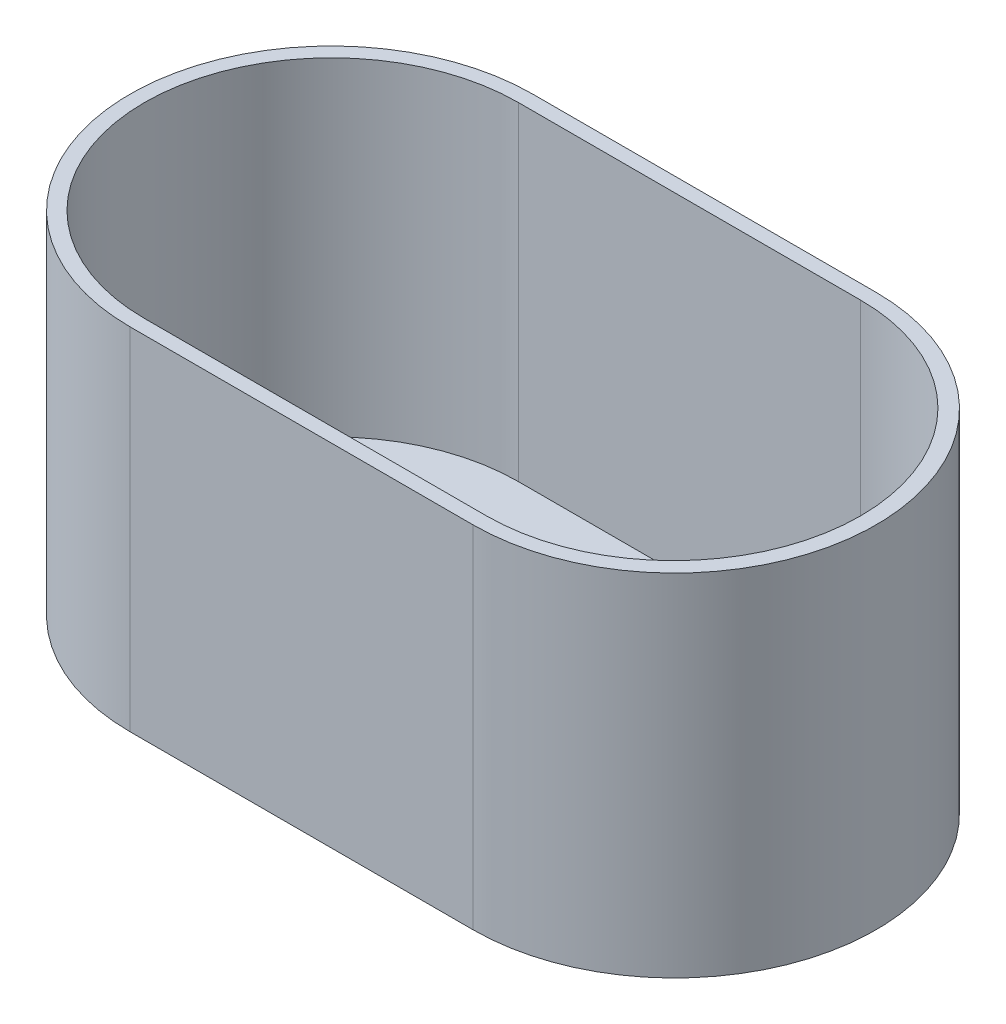
ISO-10303-21;
HEADER;
FILE_DESCRIPTION(('STEP AP214'),'2;1');
FILE_NAME('part.step','',(''),(''),'','','');
FILE_SCHEMA(('AUTOMOTIVE_DESIGN { 1 0 10303 214 1 1 1 1 }'));
ENDSEC;
DATA;
#1=APPLICATION_CONTEXT('core data for automotive mechanical design processes');
#2=APPLICATION_PROTOCOL_DEFINITION('international standard','automotive_design',2000,#1);
#3=PRODUCT_CONTEXT('',#1,'mechanical');
#4=PRODUCT('Part','Part','',(#3));
#5=PRODUCT_RELATED_PRODUCT_CATEGORY('part','',(#4));
#6=PRODUCT_DEFINITION_FORMATION('','',#4);
#7=PRODUCT_DEFINITION_CONTEXT('part definition',#1,'design');
#8=PRODUCT_DEFINITION('design','',#6,#7);
#9=PRODUCT_DEFINITION_SHAPE('','',#8);
#10=(LENGTH_UNIT() NAMED_UNIT(*) SI_UNIT(.MILLI.,.METRE.));
#11=(NAMED_UNIT(*) PLANE_ANGLE_UNIT() SI_UNIT($,.RADIAN.));
#12=(NAMED_UNIT(*) SI_UNIT($,.STERADIAN.) SOLID_ANGLE_UNIT());
#13=UNCERTAINTY_MEASURE_WITH_UNIT(LENGTH_MEASURE(1.E-05),#10,'distance_accuracy_value','');
#14=(GEOMETRIC_REPRESENTATION_CONTEXT(3) GLOBAL_UNCERTAINTY_ASSIGNED_CONTEXT((#13)) GLOBAL_UNIT_ASSIGNED_CONTEXT((#10,
#11,#12)) REPRESENTATION_CONTEXT('',''));
#15=CARTESIAN_POINT('',(0.,0.,0.));
#16=DIRECTION('',(0.,0.,1.));
#17=DIRECTION('',(1.,0.,0.));
#18=AXIS2_PLACEMENT_3D('',#15,#16,#17);
#19=CARTESIAN_POINT('',(0.,0.,0.));
#20=DIRECTION('',(0.,1.,0.));
#21=DIRECTION('',(0.,0.,1.));
#22=AXIS2_PLACEMENT_3D('',#19,#20,#21);
#23=PLANE('',#22);
#24=CARTESIAN_POINT('',(45.8562816382713,0.,0.));
#25=DIRECTION('',(0.,1.,0.));
#26=DIRECTION('',(0.,0.,1.));
#27=AXIS2_PLACEMENT_3D('',#24,#25,#26);
#28=CIRCLE('',#27,25.0593912215888);
#29=CARTESIAN_POINT('',(45.8562816382713,0.,25.0593912215888));
#30=VERTEX_POINT('',#29);
#31=CARTESIAN_POINT('',(45.8562816382713,0.,-25.0593912215888));
#32=VERTEX_POINT('',#31);
#33=EDGE_CURVE('E296',#30,#32,#28,.T.);
#34=ORIENTED_EDGE('',*,*,#33,.T.);
#35=DIRECTION('',(-1.,0.,0.));
#36=VECTOR('',#35,1.);
#37=CARTESIAN_POINT('',(0.,0.,-25.0593912215888));
#38=LINE('',#37,#36);
#39=CARTESIAN_POINT('',(0.,0.,-25.0593912215888));
#40=VERTEX_POINT('',#39);
#41=EDGE_CURVE('E43',#32,#40,#38,.T.);
#42=ORIENTED_EDGE('',*,*,#41,.T.);
#43=CARTESIAN_POINT('',(0.,0.,0.));
#44=DIRECTION('',(0.,1.,0.));
#45=DIRECTION('',(0.,0.,1.));
#46=AXIS2_PLACEMENT_3D('',#43,#44,#45);
#47=CIRCLE('',#46,25.0593912215888);
#48=CARTESIAN_POINT('',(0.,0.,25.0593912215888));
#49=VERTEX_POINT('',#48);
#50=EDGE_CURVE('E11',#40,#49,#47,.T.);
#51=ORIENTED_EDGE('',*,*,#50,.T.);
#52=DIRECTION('',(1.,0.,0.));
#53=VECTOR('',#52,1.);
#54=CARTESIAN_POINT('',(0.,0.,25.0593912215888));
#55=LINE('',#54,#53);
#56=EDGE_CURVE('E293',#49,#30,#55,.T.);
#57=ORIENTED_EDGE('',*,*,#56,.T.);
#58=EDGE_LOOP('',(#34,#42,#51,#57));
#59=FACE_BOUND('',#58,.T.);
#60=DIRECTION('',(0.,0.,-1.));
#61=VECTOR('',#60,1.);
#62=CARTESIAN_POINT('',(-9.28679565647911,0.,-11.7941977931354));
#63=LINE('',#62,#61);
#64=CARTESIAN_POINT('',(-9.28679565647911,0.,-10.0856422401896));
#65=VERTEX_POINT('',#64);
#66=CARTESIAN_POINT('',(-9.28679565647911,0.,-11.7941977931354));
#67=VERTEX_POINT('',#66);
#68=EDGE_CURVE('E201',#65,#67,#63,.T.);
#69=ORIENTED_EDGE('',*,*,#68,.F.);
#70=DIRECTION('',(1.,0.,0.));
#71=VECTOR('',#70,1.);
#72=CARTESIAN_POINT('',(-9.28679565647911,0.,-10.0856422401896));
#73=LINE('',#72,#71);
#74=CARTESIAN_POINT('',(-13.9397210193438,0.,-10.0856422401896));
#75=VERTEX_POINT('',#74);
#76=EDGE_CURVE('E198',#75,#65,#73,.T.);
#77=ORIENTED_EDGE('',*,*,#76,.F.);
#78=DIRECTION('',(0.,0.,-1.));
#79=VECTOR('',#78,1.);
#80=CARTESIAN_POINT('',(-13.9397210193438,0.,-10.0856422401896));
#81=LINE('',#80,#79);
#82=CARTESIAN_POINT('',(-13.9397210193438,0.,-4.69528190445842));
#83=VERTEX_POINT('',#82);
#84=EDGE_CURVE('E211',#83,#75,#81,.T.);
#85=ORIENTED_EDGE('',*,*,#84,.F.);
#86=DIRECTION('',(1.,0.,0.));
#87=VECTOR('',#86,1.);
#88=CARTESIAN_POINT('',(-13.9397210193438,0.,-4.69528190445842));
#89=LINE('',#88,#87);
#90=CARTESIAN_POINT('',(-15.6758199562884,0.,-4.69528190445842));
#91=VERTEX_POINT('',#90);
#92=EDGE_CURVE('E227',#91,#83,#89,.T.);
#93=ORIENTED_EDGE('',*,*,#92,.F.);
#94=DIRECTION('',(0.,0.,1.));
#95=VECTOR('',#94,1.);
#96=CARTESIAN_POINT('',(-15.6758199562884,0.,-4.69528190445842));
#97=LINE('',#96,#95);
#98=CARTESIAN_POINT('',(-15.6758199562884,0.,-11.7941977931354));
#99=VERTEX_POINT('',#98);
#100=EDGE_CURVE('E225',#99,#91,#97,.T.);
#101=ORIENTED_EDGE('',*,*,#100,.F.);
#102=DIRECTION('',(-1.,0.,0.));
#103=VECTOR('',#102,1.);
#104=CARTESIAN_POINT('',(-15.6758199562884,0.,-11.7941977931354));
#105=LINE('',#104,#103);
#106=EDGE_CURVE('E223',#67,#99,#105,.T.);
#107=ORIENTED_EDGE('',*,*,#106,.F.);
#108=EDGE_LOOP('',(#69,#77,#85,#93,#101,#107));
#109=FACE_BOUND('',#108,.T.);
#110=DIRECTION('',(0.,0.,1.));
#111=VECTOR('',#110,1.);
#112=CARTESIAN_POINT('',(21.6949015433899,0.,11.8350508077465));
#113=LINE('',#112,#111);
#114=CARTESIAN_POINT('',(21.6949015433899,0.,10.1264952548008));
#115=VERTEX_POINT('',#114);
#116=CARTESIAN_POINT('',(21.6949015433899,0.,11.8350508077465));
#117=VERTEX_POINT('',#116);
#118=EDGE_CURVE('E604',#115,#117,#113,.T.);
#119=ORIENTED_EDGE('',*,*,#118,.F.);
#120=DIRECTION('',(-1.,0.,0.));
#121=VECTOR('',#120,1.);
#122=CARTESIAN_POINT('',(21.6949015433899,0.,10.1264952548008));
#123=LINE('',#122,#121);
#124=CARTESIAN_POINT('',(26.3478269062546,0.,10.1264952548008));
#125=VERTEX_POINT('',#124);
#126=EDGE_CURVE('E196',#125,#115,#123,.T.);
#127=ORIENTED_EDGE('',*,*,#126,.F.);
#128=DIRECTION('',(0.,0.,1.));
#129=VECTOR('',#128,1.);
#130=CARTESIAN_POINT('',(26.3478269062546,0.,10.1264952548008));
#131=LINE('',#130,#129);
#132=CARTESIAN_POINT('',(26.3478269062546,0.,4.73613491906954));
#133=VERTEX_POINT('',#132);
#134=EDGE_CURVE('E192',#133,#125,#131,.T.);
#135=ORIENTED_EDGE('',*,*,#134,.F.);
#136=DIRECTION('',(-1.,0.,0.));
#137=VECTOR('',#136,1.);
#138=CARTESIAN_POINT('',(26.3478269062546,0.,4.73613491906954));
#139=LINE('',#138,#137);
#140=CARTESIAN_POINT('',(28.0839258431991,0.,4.73613491906954));
#141=VERTEX_POINT('',#140);
#142=EDGE_CURVE('E600',#141,#133,#139,.T.);
#143=ORIENTED_EDGE('',*,*,#142,.F.);
#144=DIRECTION('',(0.,0.,-1.));
#145=VECTOR('',#144,1.);
#146=CARTESIAN_POINT('',(28.0839258431991,0.,4.73613491906954));
#147=LINE('',#146,#145);
#148=CARTESIAN_POINT('',(28.0839258431991,0.,11.8350508077465));
#149=VERTEX_POINT('',#148);
#150=EDGE_CURVE('E612',#149,#141,#147,.T.);
#151=ORIENTED_EDGE('',*,*,#150,.F.);
#152=DIRECTION('',(1.,0.,0.));
#153=VECTOR('',#152,1.);
#154=CARTESIAN_POINT('',(28.0839258431991,0.,11.8350508077465));
#155=LINE('',#154,#153);
#156=EDGE_CURVE('E606',#117,#149,#155,.T.);
#157=ORIENTED_EDGE('',*,*,#156,.F.);
#158=EDGE_LOOP('',(#119,#127,#135,#143,#151,#157));
#159=FACE_BOUND('',#158,.T.);
#160=ADVANCED_FACE('F35',(#59,#109,#159),#23,.T.);
#161=CARTESIAN_POINT('',(0.,44.,0.));
#162=DIRECTION('',(0.,-1.,0.));
#163=DIRECTION('',(0.,0.,-1.));
#164=AXIS2_PLACEMENT_3D('',#161,#162,#163);
#165=CYLINDRICAL_SURFACE('',#164,27.);
#166=DIRECTION('',(0.,-1.,0.));
#167=VECTOR('',#166,1.);
#168=CARTESIAN_POINT('',(0.,44.,-27.));
#169=LINE('',#168,#167);
#170=CARTESIAN_POINT('',(0.,44.,-27.));
#171=VERTEX_POINT('',#170);
#172=CARTESIAN_POINT('',(0.,-2.99999999999999,-27.));
#173=VERTEX_POINT('',#172);
#174=EDGE_CURVE('E285',#171,#173,#169,.T.);
#175=ORIENTED_EDGE('',*,*,#174,.T.);
#176=CARTESIAN_POINT('',(0.,-2.99999999999999,0.));
#177=DIRECTION('',(0.,1.,0.));
#178=DIRECTION('',(0.,0.,1.));
#179=AXIS2_PLACEMENT_3D('',#176,#177,#178);
#180=CIRCLE('',#179,27.);
#181=CARTESIAN_POINT('',(0.,-2.99999999999999,27.));
#182=VERTEX_POINT('',#181);
#183=EDGE_CURVE('E244',#173,#182,#180,.T.);
#184=ORIENTED_EDGE('',*,*,#183,.T.);
#185=DIRECTION('',(0.,-1.,0.));
#186=VECTOR('',#185,1.);
#187=CARTESIAN_POINT('',(0.,44.,27.));
#188=LINE('',#187,#186);
#189=CARTESIAN_POINT('',(0.,44.,27.));
#190=VERTEX_POINT('',#189);
#191=EDGE_CURVE('E291',#190,#182,#188,.T.);
#192=ORIENTED_EDGE('',*,*,#191,.F.);
#193=CARTESIAN_POINT('',(0.,44.,0.));
#194=DIRECTION('',(0.,1.,0.));
#195=DIRECTION('',(0.,0.,1.));
#196=AXIS2_PLACEMENT_3D('',#193,#194,#195);
#197=CIRCLE('',#196,27.);
#198=EDGE_CURVE('E276',#171,#190,#197,.T.);
#199=ORIENTED_EDGE('',*,*,#198,.F.);
#200=EDGE_LOOP('',(#175,#184,#192,#199));
#201=FACE_BOUND('',#200,.T.);
#202=ADVANCED_FACE('F37',(#201),#165,.T.);
#203=CARTESIAN_POINT('',(0.,44.,27.));
#204=DIRECTION('',(0.,0.,-1.));
#205=DIRECTION('',(-1.,0.,0.));
#206=AXIS2_PLACEMENT_3D('',#203,#204,#205);
#207=PLANE('',#206);
#208=ORIENTED_EDGE('',*,*,#191,.T.);
#209=DIRECTION('',(1.,0.,0.));
#210=VECTOR('',#209,1.);
#211=CARTESIAN_POINT('',(0.,-2.99999999999999,27.));
#212=LINE('',#211,#210);
#213=CARTESIAN_POINT('',(46.,-2.99999999999999,27.));
#214=VERTEX_POINT('',#213);
#215=EDGE_CURVE('E247',#182,#214,#212,.T.);
#216=ORIENTED_EDGE('',*,*,#215,.T.);
#217=DIRECTION('',(0.,-1.,0.));
#218=VECTOR('',#217,1.);
#219=CARTESIAN_POINT('',(46.,44.,27.));
#220=LINE('',#219,#218);
#221=CARTESIAN_POINT('',(46.,44.,27.));
#222=VERTEX_POINT('',#221);
#223=EDGE_CURVE('E289',#222,#214,#220,.T.);
#224=ORIENTED_EDGE('',*,*,#223,.F.);
#225=DIRECTION('',(1.,0.,0.));
#226=VECTOR('',#225,1.);
#227=CARTESIAN_POINT('',(0.,44.,27.));
#228=LINE('',#227,#226);
#229=EDGE_CURVE('E279',#190,#222,#228,.T.);
#230=ORIENTED_EDGE('',*,*,#229,.F.);
#231=EDGE_LOOP('',(#208,#216,#224,#230));
#232=FACE_BOUND('',#231,.T.);
#233=ADVANCED_FACE('F334',(#232),#207,.F.);
#234=CARTESIAN_POINT('',(46.,44.,0.));
#235=DIRECTION('',(0.,-1.,0.));
#236=DIRECTION('',(0.,0.,-1.));
#237=AXIS2_PLACEMENT_3D('',#234,#235,#236);
#238=CYLINDRICAL_SURFACE('',#237,27.);
#239=ORIENTED_EDGE('',*,*,#223,.T.);
#240=CARTESIAN_POINT('',(46.,-2.99999999999999,0.));
#241=DIRECTION('',(0.,1.,0.));
#242=DIRECTION('',(0.,0.,1.));
#243=AXIS2_PLACEMENT_3D('',#240,#241,#242);
#244=CIRCLE('',#243,27.);
#245=CARTESIAN_POINT('',(46.,-2.99999999999999,-27.));
#246=VERTEX_POINT('',#245);
#247=EDGE_CURVE('E250',#214,#246,#244,.T.);
#248=ORIENTED_EDGE('',*,*,#247,.T.);
#249=DIRECTION('',(0.,-1.,0.));
#250=VECTOR('',#249,1.);
#251=CARTESIAN_POINT('',(46.,44.,-27.));
#252=LINE('',#251,#250);
#253=CARTESIAN_POINT('',(46.,44.,-27.));
#254=VERTEX_POINT('',#253);
#255=EDGE_CURVE('E287',#254,#246,#252,.T.);
#256=ORIENTED_EDGE('',*,*,#255,.F.);
#257=CARTESIAN_POINT('',(46.,44.,0.));
#258=DIRECTION('',(0.,1.,0.));
#259=DIRECTION('',(0.,0.,1.));
#260=AXIS2_PLACEMENT_3D('',#257,#258,#259);
#261=CIRCLE('',#260,27.);
#262=EDGE_CURVE('E281',#222,#254,#261,.T.);
#263=ORIENTED_EDGE('',*,*,#262,.F.);
#264=EDGE_LOOP('',(#239,#248,#256,#263));
#265=FACE_BOUND('',#264,.T.);
#266=ADVANCED_FACE('F488',(#265),#238,.T.);
#267=CARTESIAN_POINT('',(0.,44.,-27.));
#268=DIRECTION('',(0.,0.,1.));
#269=DIRECTION('',(1.,0.,0.));
#270=AXIS2_PLACEMENT_3D('',#267,#268,#269);
#271=PLANE('',#270);
#272=ORIENTED_EDGE('',*,*,#255,.T.);
#273=DIRECTION('',(-1.,0.,0.));
#274=VECTOR('',#273,1.);
#275=CARTESIAN_POINT('',(0.,-2.99999999999999,-27.));
#276=LINE('',#275,#274);
#277=EDGE_CURVE('E253',#246,#173,#276,.T.);
#278=ORIENTED_EDGE('',*,*,#277,.T.);
#279=ORIENTED_EDGE('',*,*,#174,.F.);
#280=DIRECTION('',(-1.,0.,0.));
#281=VECTOR('',#280,1.);
#282=CARTESIAN_POINT('',(0.,44.,-27.));
#283=LINE('',#282,#281);
#284=EDGE_CURVE('E283',#254,#171,#283,.T.);
#285=ORIENTED_EDGE('',*,*,#284,.F.);
#286=EDGE_LOOP('',(#272,#278,#279,#285));
#287=FACE_BOUND('',#286,.T.);
#288=ADVANCED_FACE('F504',(#287),#271,.F.);
#289=CARTESIAN_POINT('',(0.,44.,0.));
#290=DIRECTION('',(0.,1.,0.));
#291=DIRECTION('',(0.,0.,1.));
#292=AXIS2_PLACEMENT_3D('',#289,#290,#291);
#293=PLANE('',#292);
#294=CARTESIAN_POINT('',(0.,44.,0.));
#295=DIRECTION('',(0.,1.,0.));
#296=DIRECTION('',(0.,0.,1.));
#297=AXIS2_PLACEMENT_3D('',#294,#295,#296);
#298=CIRCLE('',#297,25.0593912215888);
#299=CARTESIAN_POINT('',(0.,44.,-25.0593912215888));
#300=VERTEX_POINT('',#299);
#301=CARTESIAN_POINT('',(0.,44.,25.0593912215888));
#302=VERTEX_POINT('',#301);
#303=EDGE_CURVE('E273',#300,#302,#298,.T.);
#304=ORIENTED_EDGE('',*,*,#303,.F.);
#305=DIRECTION('',(-1.,0.,0.));
#306=VECTOR('',#305,1.);
#307=CARTESIAN_POINT('',(0.,44.,-25.0593912215888));
#308=LINE('',#307,#306);
#309=CARTESIAN_POINT('',(45.8562816382713,44.,-25.0593912215888));
#310=VERTEX_POINT('',#309);
#311=EDGE_CURVE('E271',#310,#300,#308,.T.);
#312=ORIENTED_EDGE('',*,*,#311,.F.);
#313=CARTESIAN_POINT('',(45.8562816382713,44.,0.));
#314=DIRECTION('',(0.,1.,0.));
#315=DIRECTION('',(0.,0.,1.));
#316=AXIS2_PLACEMENT_3D('',#313,#314,#315);
#317=CIRCLE('',#316,25.0593912215888);
#318=CARTESIAN_POINT('',(45.8562816382713,44.,25.0593912215888));
#319=VERTEX_POINT('',#318);
#320=EDGE_CURVE('E269',#319,#310,#317,.T.);
#321=ORIENTED_EDGE('',*,*,#320,.F.);
#322=DIRECTION('',(1.,0.,0.));
#323=VECTOR('',#322,1.);
#324=CARTESIAN_POINT('',(0.,44.,25.0593912215888));
#325=LINE('',#324,#323);
#326=EDGE_CURVE('E260',#302,#319,#325,.T.);
#327=ORIENTED_EDGE('',*,*,#326,.F.);
#328=EDGE_LOOP('',(#304,#312,#321,#327));
#329=FACE_BOUND('',#328,.T.);
#330=ORIENTED_EDGE('',*,*,#198,.T.);
#331=ORIENTED_EDGE('',*,*,#229,.T.);
#332=ORIENTED_EDGE('',*,*,#262,.T.);
#333=ORIENTED_EDGE('',*,*,#284,.T.);
#334=EDGE_LOOP('',(#330,#331,#332,#333));
#335=FACE_BOUND('',#334,.T.);
#336=ADVANCED_FACE('F313',(#329,#335),#293,.T.);
#337=CARTESIAN_POINT('',(0.,-2.,0.));
#338=DIRECTION('',(0.,1.,0.));
#339=DIRECTION('',(0.,0.,1.));
#340=AXIS2_PLACEMENT_3D('',#337,#338,#339);
#341=CYLINDRICAL_SURFACE('',#340,25.0593912215888);
#342=ORIENTED_EDGE('',*,*,#303,.T.);
#343=DIRECTION('',(0.,1.,0.));
#344=VECTOR('',#343,1.);
#345=CARTESIAN_POINT('',(0.,-2.,25.0593912215888));
#346=LINE('',#345,#344);
#347=EDGE_CURVE('E256',#49,#302,#346,.T.);
#348=ORIENTED_EDGE('',*,*,#347,.F.);
#349=ORIENTED_EDGE('',*,*,#50,.F.);
#350=DIRECTION('',(0.,1.,0.));
#351=VECTOR('',#350,1.);
#352=CARTESIAN_POINT('',(0.,-2.,-25.0593912215888));
#353=LINE('',#352,#351);
#354=EDGE_CURVE('E257',#40,#300,#353,.T.);
#355=ORIENTED_EDGE('',*,*,#354,.T.);
#356=EDGE_LOOP('',(#342,#348,#349,#355));
#357=FACE_BOUND('',#356,.T.);
#358=ADVANCED_FACE('F309',(#357),#341,.F.);
#359=CARTESIAN_POINT('',(0.,-2.,-25.0593912215888));
#360=DIRECTION('',(0.,0.,-1.));
#361=DIRECTION('',(-1.,0.,0.));
#362=AXIS2_PLACEMENT_3D('',#359,#360,#361);
#363=PLANE('',#362);
#364=ORIENTED_EDGE('',*,*,#311,.T.);
#365=ORIENTED_EDGE('',*,*,#354,.F.);
#366=ORIENTED_EDGE('',*,*,#41,.F.);
#367=DIRECTION('',(0.,1.,0.));
#368=VECTOR('',#367,1.);
#369=CARTESIAN_POINT('',(45.8562816382713,-2.,-25.0593912215888));
#370=LINE('',#369,#368);
#371=EDGE_CURVE('E261',#32,#310,#370,.T.);
#372=ORIENTED_EDGE('',*,*,#371,.T.);
#373=EDGE_LOOP('',(#364,#365,#366,#372));
#374=FACE_BOUND('',#373,.T.);
#375=ADVANCED_FACE('F305',(#374),#363,.F.);
#376=CARTESIAN_POINT('',(45.8562816382713,-2.,0.));
#377=DIRECTION('',(0.,1.,0.));
#378=DIRECTION('',(0.,0.,1.));
#379=AXIS2_PLACEMENT_3D('',#376,#377,#378);
#380=CYLINDRICAL_SURFACE('',#379,25.0593912215888);
#381=ORIENTED_EDGE('',*,*,#320,.T.);
#382=ORIENTED_EDGE('',*,*,#371,.F.);
#383=ORIENTED_EDGE('',*,*,#33,.F.);
#384=DIRECTION('',(0.,1.,0.));
#385=VECTOR('',#384,1.);
#386=CARTESIAN_POINT('',(45.8562816382713,-2.,25.0593912215888));
#387=LINE('',#386,#385);
#388=EDGE_CURVE('E264',#30,#319,#387,.T.);
#389=ORIENTED_EDGE('',*,*,#388,.T.);
#390=EDGE_LOOP('',(#381,#382,#383,#389));
#391=FACE_BOUND('',#390,.T.);
#392=ADVANCED_FACE('F319',(#391),#380,.F.);
#393=CARTESIAN_POINT('',(0.,-2.,25.0593912215888));
#394=DIRECTION('',(0.,0.,1.));
#395=DIRECTION('',(1.,0.,0.));
#396=AXIS2_PLACEMENT_3D('',#393,#394,#395);
#397=PLANE('',#396);
#398=ORIENTED_EDGE('',*,*,#326,.T.);
#399=ORIENTED_EDGE('',*,*,#388,.F.);
#400=ORIENTED_EDGE('',*,*,#56,.F.);
#401=ORIENTED_EDGE('',*,*,#347,.T.);
#402=EDGE_LOOP('',(#398,#399,#400,#401));
#403=FACE_BOUND('',#402,.T.);
#404=ADVANCED_FACE('F317',(#403),#397,.F.);
#405=CARTESIAN_POINT('',(0.,-2.99999999999999,0.));
#406=DIRECTION('',(0.,1.,0.));
#407=DIRECTION('',(0.,0.,1.));
#408=AXIS2_PLACEMENT_3D('',#405,#406,#407);
#409=PLANE('',#408);
#410=ORIENTED_EDGE('',*,*,#183,.F.);
#411=ORIENTED_EDGE('',*,*,#277,.F.);
#412=ORIENTED_EDGE('',*,*,#247,.F.);
#413=ORIENTED_EDGE('',*,*,#215,.F.);
#414=EDGE_LOOP('',(#410,#411,#412,#413));
#415=FACE_BOUND('',#414,.T.);
#416=ADVANCED_FACE('F326',(#415),#409,.F.);
#417=CARTESIAN_POINT('',(-9.28679565647911,2.99999999999999,-10.0856422401896));
#418=DIRECTION('',(0.,0.,-1.));
#419=DIRECTION('',(-1.,0.,0.));
#420=AXIS2_PLACEMENT_3D('',#417,#418,#419);
#421=PLANE('',#420);
#422=ORIENTED_EDGE('',*,*,#76,.T.);
#423=DIRECTION('',(0.,-1.,0.));
#424=VECTOR('',#423,1.);
#425=CARTESIAN_POINT('',(-9.28679565647911,2.99999999999999,-10.0856422401896));
#426=LINE('',#425,#424);
#427=CARTESIAN_POINT('',(-9.28679565647911,2.99999999999999,-10.0856422401896));
#428=VERTEX_POINT('',#427);
#429=EDGE_CURVE('E242',#428,#65,#426,.T.);
#430=ORIENTED_EDGE('',*,*,#429,.F.);
#431=DIRECTION('',(1.,0.,0.));
#432=VECTOR('',#431,1.);
#433=CARTESIAN_POINT('',(-9.28679565647911,2.99999999999999,-10.0856422401896));
#434=LINE('',#433,#432);
#435=CARTESIAN_POINT('',(-13.9397210193438,2.99999999999999,-10.0856422401896));
#436=VERTEX_POINT('',#435);
#437=EDGE_CURVE('E207',#436,#428,#434,.T.);
#438=ORIENTED_EDGE('',*,*,#437,.F.);
#439=DIRECTION('',(0.,-1.,0.));
#440=VECTOR('',#439,1.);
#441=CARTESIAN_POINT('',(-13.9397210193438,2.99999999999999,-10.0856422401896));
#442=LINE('',#441,#440);
#443=EDGE_CURVE('E220',#436,#75,#442,.T.);
#444=ORIENTED_EDGE('',*,*,#443,.T.);
#445=EDGE_LOOP('',(#422,#430,#438,#444));
#446=FACE_BOUND('',#445,.T.);
#447=ADVANCED_FACE('F339',(#446),#421,.F.);
#448=CARTESIAN_POINT('',(-9.28679565647911,2.99999999999999,-11.7941977931354));
#449=DIRECTION('',(-1.,0.,0.));
#450=DIRECTION('',(0.,0.,1.));
#451=AXIS2_PLACEMENT_3D('',#448,#449,#450);
#452=PLANE('',#451);
#453=ORIENTED_EDGE('',*,*,#68,.T.);
#454=DIRECTION('',(0.,-1.,0.));
#455=VECTOR('',#454,1.);
#456=CARTESIAN_POINT('',(-9.28679565647911,2.99999999999999,-11.7941977931354));
#457=LINE('',#456,#455);
#458=CARTESIAN_POINT('',(-9.28679565647911,2.99999999999999,-11.7941977931354));
#459=VERTEX_POINT('',#458);
#460=EDGE_CURVE('E239',#459,#67,#457,.T.);
#461=ORIENTED_EDGE('',*,*,#460,.F.);
#462=DIRECTION('',(0.,0.,-1.));
#463=VECTOR('',#462,1.);
#464=CARTESIAN_POINT('',(-9.28679565647911,2.99999999999999,-11.7941977931354));
#465=LINE('',#464,#463);
#466=EDGE_CURVE('E210',#428,#459,#465,.T.);
#467=ORIENTED_EDGE('',*,*,#466,.F.);
#468=ORIENTED_EDGE('',*,*,#429,.T.);
#469=EDGE_LOOP('',(#453,#461,#467,#468));
#470=FACE_BOUND('',#469,.T.);
#471=ADVANCED_FACE('F343',(#470),#452,.F.);
#472=CARTESIAN_POINT('',(-15.6758199562884,2.99999999999999,-11.7941977931354));
#473=DIRECTION('',(0.,0.,1.));
#474=DIRECTION('',(1.,0.,0.));
#475=AXIS2_PLACEMENT_3D('',#472,#473,#474);
#476=PLANE('',#475);
#477=ORIENTED_EDGE('',*,*,#106,.T.);
#478=DIRECTION('',(0.,-1.,0.));
#479=VECTOR('',#478,1.);
#480=CARTESIAN_POINT('',(-15.6758199562884,2.99999999999999,-11.7941977931354));
#481=LINE('',#480,#479);
#482=CARTESIAN_POINT('',(-15.6758199562884,2.99999999999999,-11.7941977931354));
#483=VERTEX_POINT('',#482);
#484=EDGE_CURVE('E236',#483,#99,#481,.T.);
#485=ORIENTED_EDGE('',*,*,#484,.F.);
#486=DIRECTION('',(-1.,0.,0.));
#487=VECTOR('',#486,1.);
#488=CARTESIAN_POINT('',(-15.6758199562884,2.99999999999999,-11.7941977931354));
#489=LINE('',#488,#487);
#490=EDGE_CURVE('E213',#459,#483,#489,.T.);
#491=ORIENTED_EDGE('',*,*,#490,.F.);
#492=ORIENTED_EDGE('',*,*,#460,.T.);
#493=EDGE_LOOP('',(#477,#485,#491,#492));
#494=FACE_BOUND('',#493,.T.);
#495=ADVANCED_FACE('F347',(#494),#476,.F.);
#496=CARTESIAN_POINT('',(-15.6758199562884,2.99999999999999,-4.69528190445842));
#497=DIRECTION('',(1.,0.,0.));
#498=DIRECTION('',(0.,0.,-1.));
#499=AXIS2_PLACEMENT_3D('',#496,#497,#498);
#500=PLANE('',#499);
#501=ORIENTED_EDGE('',*,*,#100,.T.);
#502=DIRECTION('',(0.,-1.,0.));
#503=VECTOR('',#502,1.);
#504=CARTESIAN_POINT('',(-15.6758199562884,2.99999999999999,-4.69528190445842));
#505=LINE('',#504,#503);
#506=CARTESIAN_POINT('',(-15.6758199562884,2.99999999999999,-4.69528190445842));
#507=VERTEX_POINT('',#506);
#508=EDGE_CURVE('E233',#507,#91,#505,.T.);
#509=ORIENTED_EDGE('',*,*,#508,.F.);
#510=DIRECTION('',(0.,0.,1.));
#511=VECTOR('',#510,1.);
#512=CARTESIAN_POINT('',(-15.6758199562884,2.99999999999999,-4.69528190445842));
#513=LINE('',#512,#511);
#514=EDGE_CURVE('E215',#483,#507,#513,.T.);
#515=ORIENTED_EDGE('',*,*,#514,.F.);
#516=ORIENTED_EDGE('',*,*,#484,.T.);
#517=EDGE_LOOP('',(#501,#509,#515,#516));
#518=FACE_BOUND('',#517,.T.);
#519=ADVANCED_FACE('F351',(#518),#500,.F.);
#520=CARTESIAN_POINT('',(-13.9397210193438,2.99999999999999,-4.69528190445842));
#521=DIRECTION('',(0.,0.,-1.));
#522=DIRECTION('',(-1.,0.,0.));
#523=AXIS2_PLACEMENT_3D('',#520,#521,#522);
#524=PLANE('',#523);
#525=ORIENTED_EDGE('',*,*,#92,.T.);
#526=DIRECTION('',(0.,-1.,0.));
#527=VECTOR('',#526,1.);
#528=CARTESIAN_POINT('',(-13.9397210193438,2.99999999999999,-4.69528190445842));
#529=LINE('',#528,#527);
#530=CARTESIAN_POINT('',(-13.9397210193438,2.99999999999999,-4.69528190445842));
#531=VERTEX_POINT('',#530);
#532=EDGE_CURVE('E58',#531,#83,#529,.T.);
#533=ORIENTED_EDGE('',*,*,#532,.F.);
#534=DIRECTION('',(1.,0.,0.));
#535=VECTOR('',#534,1.);
#536=CARTESIAN_POINT('',(-13.9397210193438,2.99999999999999,-4.69528190445842));
#537=LINE('',#536,#535);
#538=EDGE_CURVE('E217',#507,#531,#537,.T.);
#539=ORIENTED_EDGE('',*,*,#538,.F.);
#540=ORIENTED_EDGE('',*,*,#508,.T.);
#541=EDGE_LOOP('',(#525,#533,#539,#540));
#542=FACE_BOUND('',#541,.T.);
#543=ADVANCED_FACE('F355',(#542),#524,.F.);
#544=CARTESIAN_POINT('',(-13.9397210193438,2.99999999999999,-10.0856422401896));
#545=DIRECTION('',(-1.,0.,0.));
#546=DIRECTION('',(0.,0.,1.));
#547=AXIS2_PLACEMENT_3D('',#544,#545,#546);
#548=PLANE('',#547);
#549=ORIENTED_EDGE('',*,*,#84,.T.);
#550=ORIENTED_EDGE('',*,*,#443,.F.);
#551=DIRECTION('',(0.,0.,-1.));
#552=VECTOR('',#551,1.);
#553=CARTESIAN_POINT('',(-13.9397210193438,2.99999999999999,-10.0856422401896));
#554=LINE('',#553,#552);
#555=EDGE_CURVE('E219',#531,#436,#554,.T.);
#556=ORIENTED_EDGE('',*,*,#555,.F.);
#557=ORIENTED_EDGE('',*,*,#532,.T.);
#558=EDGE_LOOP('',(#549,#550,#556,#557));
#559=FACE_BOUND('',#558,.T.);
#560=ADVANCED_FACE('F359',(#559),#548,.F.);
#561=CARTESIAN_POINT('',(0.,2.99999999999999,0.));
#562=DIRECTION('',(0.,1.,0.));
#563=DIRECTION('',(0.,0.,1.));
#564=AXIS2_PLACEMENT_3D('',#561,#562,#563);
#565=PLANE('',#564);
#566=ORIENTED_EDGE('',*,*,#437,.T.);
#567=ORIENTED_EDGE('',*,*,#466,.T.);
#568=ORIENTED_EDGE('',*,*,#490,.T.);
#569=ORIENTED_EDGE('',*,*,#514,.T.);
#570=ORIENTED_EDGE('',*,*,#538,.T.);
#571=ORIENTED_EDGE('',*,*,#555,.T.);
#572=EDGE_LOOP('',(#566,#567,#568,#569,#570,#571));
#573=FACE_BOUND('',#572,.T.);
#574=ADVANCED_FACE('F363',(#573),#565,.T.);
#575=CARTESIAN_POINT('',(21.6949015433899,2.99999999999999,10.1264952548008));
#576=DIRECTION('',(0.,0.,1.));
#577=DIRECTION('',(1.,0.,0.));
#578=AXIS2_PLACEMENT_3D('',#575,#576,#577);
#579=PLANE('',#578);
#580=ORIENTED_EDGE('',*,*,#126,.T.);
#581=DIRECTION('',(0.,-1.,0.));
#582=VECTOR('',#581,1.);
#583=CARTESIAN_POINT('',(21.6949015433899,2.99999999999999,10.1264952548008));
#584=LINE('',#583,#582);
#585=CARTESIAN_POINT('',(21.6949015433899,2.99999999999999,10.1264952548008));
#586=VERTEX_POINT('',#585);
#587=EDGE_CURVE('E177',#586,#115,#584,.T.);
#588=ORIENTED_EDGE('',*,*,#587,.F.);
#589=DIRECTION('',(-1.,0.,0.));
#590=VECTOR('',#589,1.);
#591=CARTESIAN_POINT('',(21.6949015433899,2.99999999999999,10.1264952548008));
#592=LINE('',#591,#590);
#593=CARTESIAN_POINT('',(26.3478269062546,2.99999999999999,10.1264952548008));
#594=VERTEX_POINT('',#593);
#595=EDGE_CURVE('E184',#594,#586,#592,.T.);
#596=ORIENTED_EDGE('',*,*,#595,.F.);
#597=DIRECTION('',(0.,-1.,0.));
#598=VECTOR('',#597,1.);
#599=CARTESIAN_POINT('',(26.3478269062546,2.99999999999999,10.1264952548008));
#600=LINE('',#599,#598);
#601=EDGE_CURVE('E597',#594,#125,#600,.T.);
#602=ORIENTED_EDGE('',*,*,#601,.T.);
#603=EDGE_LOOP('',(#580,#588,#596,#602));
#604=FACE_BOUND('',#603,.T.);
#605=ADVANCED_FACE('F194',(#604),#579,.F.);
#606=CARTESIAN_POINT('',(21.6949015433899,2.99999999999999,11.8350508077465));
#607=DIRECTION('',(1.,0.,0.));
#608=DIRECTION('',(0.,0.,-1.));
#609=AXIS2_PLACEMENT_3D('',#606,#607,#608);
#610=PLANE('',#609);
#611=ORIENTED_EDGE('',*,*,#118,.T.);
#612=DIRECTION('',(0.,-1.,0.));
#613=VECTOR('',#612,1.);
#614=CARTESIAN_POINT('',(21.6949015433899,2.99999999999999,11.8350508077465));
#615=LINE('',#614,#613);
#616=CARTESIAN_POINT('',(21.6949015433899,2.99999999999999,11.8350508077465));
#617=VERTEX_POINT('',#616);
#618=EDGE_CURVE('E180',#617,#117,#615,.T.);
#619=ORIENTED_EDGE('',*,*,#618,.F.);
#620=DIRECTION('',(0.,0.,1.));
#621=VECTOR('',#620,1.);
#622=CARTESIAN_POINT('',(21.6949015433899,2.99999999999999,11.8350508077465));
#623=LINE('',#622,#621);
#624=EDGE_CURVE('E173',#586,#617,#623,.T.);
#625=ORIENTED_EDGE('',*,*,#624,.F.);
#626=ORIENTED_EDGE('',*,*,#587,.T.);
#627=EDGE_LOOP('',(#611,#619,#625,#626));
#628=FACE_BOUND('',#627,.T.);
#629=ADVANCED_FACE('F175',(#628),#610,.F.);
#630=CARTESIAN_POINT('',(28.0839258431991,2.99999999999999,11.8350508077465));
#631=DIRECTION('',(0.,0.,-1.));
#632=DIRECTION('',(-1.,0.,0.));
#633=AXIS2_PLACEMENT_3D('',#630,#631,#632);
#634=PLANE('',#633);
#635=ORIENTED_EDGE('',*,*,#156,.T.);
#636=DIRECTION('',(0.,-1.,0.));
#637=VECTOR('',#636,1.);
#638=CARTESIAN_POINT('',(28.0839258431991,2.99999999999999,11.8350508077465));
#639=LINE('',#638,#637);
#640=CARTESIAN_POINT('',(28.0839258431991,2.99999999999999,11.8350508077465));
#641=VERTEX_POINT('',#640);
#642=EDGE_CURVE('E203',#641,#149,#639,.T.);
#643=ORIENTED_EDGE('',*,*,#642,.F.);
#644=DIRECTION('',(1.,0.,0.));
#645=VECTOR('',#644,1.);
#646=CARTESIAN_POINT('',(28.0839258431991,2.99999999999999,11.8350508077465));
#647=LINE('',#646,#645);
#648=EDGE_CURVE('E183',#617,#641,#647,.T.);
#649=ORIENTED_EDGE('',*,*,#648,.F.);
#650=ORIENTED_EDGE('',*,*,#618,.T.);
#651=EDGE_LOOP('',(#635,#643,#649,#650));
#652=FACE_BOUND('',#651,.T.);
#653=ADVANCED_FACE('F371',(#652),#634,.F.);
#654=CARTESIAN_POINT('',(28.0839258431991,2.99999999999999,4.73613491906954));
#655=DIRECTION('',(-1.,0.,0.));
#656=DIRECTION('',(0.,0.,1.));
#657=AXIS2_PLACEMENT_3D('',#654,#655,#656);
#658=PLANE('',#657);
#659=ORIENTED_EDGE('',*,*,#150,.T.);
#660=DIRECTION('',(0.,-1.,0.));
#661=VECTOR('',#660,1.);
#662=CARTESIAN_POINT('',(28.0839258431991,2.99999999999999,4.73613491906954));
#663=LINE('',#662,#661);
#664=CARTESIAN_POINT('',(28.0839258431991,2.99999999999999,4.73613491906954));
#665=VERTEX_POINT('',#664);
#666=EDGE_CURVE('E616',#665,#141,#663,.T.);
#667=ORIENTED_EDGE('',*,*,#666,.F.);
#668=DIRECTION('',(0.,0.,-1.));
#669=VECTOR('',#668,1.);
#670=CARTESIAN_POINT('',(28.0839258431991,2.99999999999999,4.73613491906954));
#671=LINE('',#670,#669);
#672=EDGE_CURVE('E623',#641,#665,#671,.T.);
#673=ORIENTED_EDGE('',*,*,#672,.F.);
#674=ORIENTED_EDGE('',*,*,#642,.T.);
#675=EDGE_LOOP('',(#659,#667,#673,#674));
#676=FACE_BOUND('',#675,.T.);
#677=ADVANCED_FACE('F374',(#676),#658,.F.);
#678=CARTESIAN_POINT('',(26.3478269062546,2.99999999999999,4.73613491906954));
#679=DIRECTION('',(0.,0.,1.));
#680=DIRECTION('',(1.,0.,0.));
#681=AXIS2_PLACEMENT_3D('',#678,#679,#680);
#682=PLANE('',#681);
#683=ORIENTED_EDGE('',*,*,#142,.T.);
#684=DIRECTION('',(0.,-1.,0.));
#685=VECTOR('',#684,1.);
#686=CARTESIAN_POINT('',(26.3478269062546,2.99999999999999,4.73613491906954));
#687=LINE('',#686,#685);
#688=CARTESIAN_POINT('',(26.3478269062546,2.99999999999999,4.73613491906954));
#689=VERTEX_POINT('',#688);
#690=EDGE_CURVE('E50',#689,#133,#687,.T.);
#691=ORIENTED_EDGE('',*,*,#690,.F.);
#692=DIRECTION('',(-1.,0.,0.));
#693=VECTOR('',#692,1.);
#694=CARTESIAN_POINT('',(26.3478269062546,2.99999999999999,4.73613491906954));
#695=LINE('',#694,#693);
#696=EDGE_CURVE('E625',#665,#689,#695,.T.);
#697=ORIENTED_EDGE('',*,*,#696,.F.);
#698=ORIENTED_EDGE('',*,*,#666,.T.);
#699=EDGE_LOOP('',(#683,#691,#697,#698));
#700=FACE_BOUND('',#699,.T.);
#701=ADVANCED_FACE('F378',(#700),#682,.F.);
#702=CARTESIAN_POINT('',(26.3478269062546,2.99999999999999,10.1264952548008));
#703=DIRECTION('',(1.,0.,0.));
#704=DIRECTION('',(0.,0.,-1.));
#705=AXIS2_PLACEMENT_3D('',#702,#703,#704);
#706=PLANE('',#705);
#707=ORIENTED_EDGE('',*,*,#134,.T.);
#708=ORIENTED_EDGE('',*,*,#601,.F.);
#709=DIRECTION('',(0.,0.,1.));
#710=VECTOR('',#709,1.);
#711=CARTESIAN_POINT('',(26.3478269062546,2.99999999999999,10.1264952548008));
#712=LINE('',#711,#710);
#713=EDGE_CURVE('E188',#689,#594,#712,.T.);
#714=ORIENTED_EDGE('',*,*,#713,.F.);
#715=ORIENTED_EDGE('',*,*,#690,.T.);
#716=EDGE_LOOP('',(#707,#708,#714,#715));
#717=FACE_BOUND('',#716,.T.);
#718=ADVANCED_FACE('F382',(#717),#706,.F.);
#719=CARTESIAN_POINT('',(0.,2.99999999999999,0.));
#720=DIRECTION('',(0.,1.,0.));
#721=DIRECTION('',(0.,0.,1.));
#722=AXIS2_PLACEMENT_3D('',#719,#720,#721);
#723=PLANE('',#722);
#724=ORIENTED_EDGE('',*,*,#595,.T.);
#725=ORIENTED_EDGE('',*,*,#624,.T.);
#726=ORIENTED_EDGE('',*,*,#648,.T.);
#727=ORIENTED_EDGE('',*,*,#672,.T.);
#728=ORIENTED_EDGE('',*,*,#696,.T.);
#729=ORIENTED_EDGE('',*,*,#713,.T.);
#730=EDGE_LOOP('',(#724,#725,#726,#727,#728,#729));
#731=FACE_BOUND('',#730,.T.);
#732=ADVANCED_FACE('F187',(#731),#723,.T.);
#733=CLOSED_SHELL('',(#160,#202,#233,#266,#288,#336,#358,#375,#392,#404,#416,#447,#471,#495,
#519,#543,#560,#574,#605,#629,#653,#677,#701,#718,#732));
#734=MANIFOLD_SOLID_BREP('B2',#733);
#735=ADVANCED_BREP_SHAPE_REPRESENTATION('',(#18,#734),#14);
#736=SHAPE_DEFINITION_REPRESENTATION(#9,#735);
ENDSEC;
END-ISO-10303-21;
